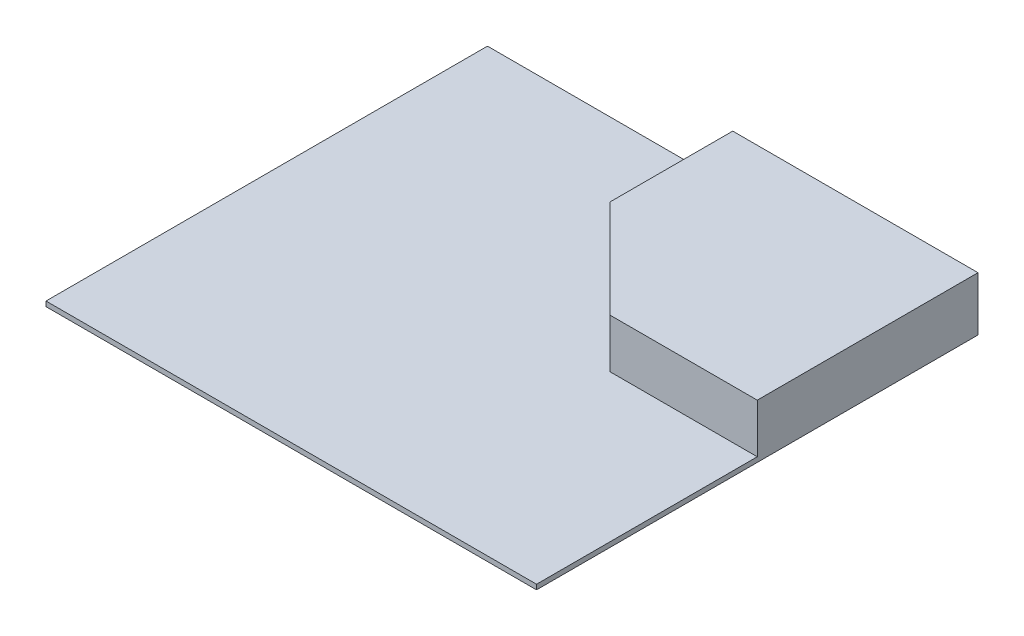
ISO-10303-21;
HEADER;
FILE_DESCRIPTION(('STEP AP214'),'2;1');
FILE_NAME('part.step','',(''),(''),'','','');
FILE_SCHEMA(('AUTOMOTIVE_DESIGN { 1 0 10303 214 1 1 1 1 }'));
ENDSEC;
DATA;
#1=APPLICATION_CONTEXT('core data for automotive mechanical design processes');
#2=APPLICATION_PROTOCOL_DEFINITION('international standard','automotive_design',2000,#1);
#3=PRODUCT_CONTEXT('',#1,'mechanical');
#4=PRODUCT('Part','Part','',(#3));
#5=PRODUCT_RELATED_PRODUCT_CATEGORY('part','',(#4));
#6=PRODUCT_DEFINITION_FORMATION('','',#4);
#7=PRODUCT_DEFINITION_CONTEXT('part definition',#1,'design');
#8=PRODUCT_DEFINITION('design','',#6,#7);
#9=PRODUCT_DEFINITION_SHAPE('','',#8);
#10=(LENGTH_UNIT() NAMED_UNIT(*) SI_UNIT(.MILLI.,.METRE.));
#11=(NAMED_UNIT(*) PLANE_ANGLE_UNIT() SI_UNIT($,.RADIAN.));
#12=(NAMED_UNIT(*) SI_UNIT($,.STERADIAN.) SOLID_ANGLE_UNIT());
#13=UNCERTAINTY_MEASURE_WITH_UNIT(LENGTH_MEASURE(1.E-05),#10,'distance_accuracy_value','');
#14=(GEOMETRIC_REPRESENTATION_CONTEXT(3) GLOBAL_UNCERTAINTY_ASSIGNED_CONTEXT((#13)) GLOBAL_UNIT_ASSIGNED_CONTEXT((#10,
#11,#12)) REPRESENTATION_CONTEXT('',''));
#15=CARTESIAN_POINT('',(0.,0.,0.));
#16=DIRECTION('',(0.,0.,1.));
#17=DIRECTION('',(1.,0.,0.));
#18=AXIS2_PLACEMENT_3D('',#15,#16,#17);
#19=CARTESIAN_POINT('',(0.,10.,0.));
#20=DIRECTION('',(0.,-1.,0.));
#21=DIRECTION('',(0.,0.,-1.));
#22=AXIS2_PLACEMENT_3D('',#19,#20,#21);
#23=PLANE('',#22);
#24=DIRECTION('',(1.,0.,0.));
#25=VECTOR('',#24,1.);
#26=CARTESIAN_POINT('',(200.,10.,0.));
#27=LINE('',#26,#25);
#28=CARTESIAN_POINT('',(200.,10.,0.));
#29=VERTEX_POINT('',#28);
#30=CARTESIAN_POINT('',(500.,10.,0.));
#31=VERTEX_POINT('',#30);
#32=EDGE_CURVE('E49',#29,#31,#27,.T.);
#33=ORIENTED_EDGE('',*,*,#32,.F.);
#34=DIRECTION('',(0.707106781186547,0.,0.707106781186548));
#35=VECTOR('',#34,1.);
#36=CARTESIAN_POINT('',(0.,10.,-200.));
#37=LINE('',#36,#35);
#38=CARTESIAN_POINT('',(0.,10.,-200.));
#39=VERTEX_POINT('',#38);
#40=EDGE_CURVE('E160',#39,#29,#37,.T.);
#41=ORIENTED_EDGE('',*,*,#40,.F.);
#42=DIRECTION('',(0.,0.,1.));
#43=VECTOR('',#42,1.);
#44=CARTESIAN_POINT('',(0.,10.,-450.));
#45=LINE('',#44,#43);
#46=CARTESIAN_POINT('',(0.,10.,-450.));
#47=VERTEX_POINT('',#46);
#48=EDGE_CURVE('E159',#47,#39,#45,.T.);
#49=ORIENTED_EDGE('',*,*,#48,.F.);
#50=DIRECTION('',(1.,0.,0.));
#51=VECTOR('',#50,1.);
#52=CARTESIAN_POINT('',(-500.,10.,-450.));
#53=LINE('',#52,#51);
#54=CARTESIAN_POINT('',(-500.,10.,-450.));
#55=VERTEX_POINT('',#54);
#56=EDGE_CURVE('E119',#55,#47,#53,.T.);
#57=ORIENTED_EDGE('',*,*,#56,.F.);
#58=DIRECTION('',(0.,0.,1.));
#59=VECTOR('',#58,1.);
#60=CARTESIAN_POINT('',(-500.,10.,-450.));
#61=LINE('',#60,#59);
#62=CARTESIAN_POINT('',(-500.,10.,450.));
#63=VERTEX_POINT('',#62);
#64=EDGE_CURVE('E134',#55,#63,#61,.T.);
#65=ORIENTED_EDGE('',*,*,#64,.T.);
#66=DIRECTION('',(1.,0.,0.));
#67=VECTOR('',#66,1.);
#68=CARTESIAN_POINT('',(-500.,10.,450.));
#69=LINE('',#68,#67);
#70=CARTESIAN_POINT('',(500.,10.,450.));
#71=VERTEX_POINT('',#70);
#72=EDGE_CURVE('E132',#63,#71,#69,.T.);
#73=ORIENTED_EDGE('',*,*,#72,.T.);
#74=DIRECTION('',(0.,0.,1.));
#75=VECTOR('',#74,1.);
#76=CARTESIAN_POINT('',(500.,10.,-450.));
#77=LINE('',#76,#75);
#78=EDGE_CURVE('E54',#31,#71,#77,.T.);
#79=ORIENTED_EDGE('',*,*,#78,.F.);
#80=EDGE_LOOP('',(#33,#41,#49,#57,#65,#73,#79));
#81=FACE_BOUND('',#80,.T.);
#82=ADVANCED_FACE('F32',(#81),#23,.F.);
#83=CARTESIAN_POINT('',(-500.,10.,-450.));
#84=DIRECTION('',(0.,0.,-1.));
#85=DIRECTION('',(-1.,0.,0.));
#86=AXIS2_PLACEMENT_3D('',#83,#84,#85);
#87=PLANE('',#86);
#88=DIRECTION('',(1.,0.,0.));
#89=VECTOR('',#88,1.);
#90=CARTESIAN_POINT('',(-500.,0.,-450.));
#91=LINE('',#90,#89);
#92=CARTESIAN_POINT('',(-500.,0.,-450.));
#93=VERTEX_POINT('',#92);
#94=CARTESIAN_POINT('',(500.,0.,-450.));
#95=VERTEX_POINT('',#94);
#96=EDGE_CURVE('E120',#93,#95,#91,.T.);
#97=ORIENTED_EDGE('',*,*,#96,.F.);
#98=DIRECTION('',(0.,-1.,0.));
#99=VECTOR('',#98,1.);
#100=CARTESIAN_POINT('',(-500.,10.,-450.));
#101=LINE('',#100,#99);
#102=EDGE_CURVE('E11',#55,#93,#101,.T.);
#103=ORIENTED_EDGE('',*,*,#102,.F.);
#104=ORIENTED_EDGE('',*,*,#56,.T.);
#105=DIRECTION('',(0.,-1.,0.));
#106=VECTOR('',#105,1.);
#107=CARTESIAN_POINT('',(0.,110.,-450.));
#108=LINE('',#107,#106);
#109=CARTESIAN_POINT('',(0.,110.,-450.));
#110=VERTEX_POINT('',#109);
#111=EDGE_CURVE('E101',#110,#47,#108,.T.);
#112=ORIENTED_EDGE('',*,*,#111,.F.);
#113=DIRECTION('',(-1.,0.,0.));
#114=VECTOR('',#113,1.);
#115=CARTESIAN_POINT('',(500.,110.,-450.));
#116=LINE('',#115,#114);
#117=CARTESIAN_POINT('',(500.,110.,-450.));
#118=VERTEX_POINT('',#117);
#119=EDGE_CURVE('E107',#118,#110,#116,.T.);
#120=ORIENTED_EDGE('',*,*,#119,.F.);
#121=DIRECTION('',(0.,-1.,0.));
#122=VECTOR('',#121,1.);
#123=CARTESIAN_POINT('',(500.,10.,-450.));
#124=LINE('',#123,#122);
#125=EDGE_CURVE('E36',#118,#95,#124,.T.);
#126=ORIENTED_EDGE('',*,*,#125,.T.);
#127=EDGE_LOOP('',(#97,#103,#104,#112,#120,#126));
#128=FACE_BOUND('',#127,.T.);
#129=ADVANCED_FACE('F34',(#128),#87,.T.);
#130=CARTESIAN_POINT('',(-500.,10.,-450.));
#131=DIRECTION('',(1.,0.,0.));
#132=DIRECTION('',(0.,0.,-1.));
#133=AXIS2_PLACEMENT_3D('',#130,#131,#132);
#134=PLANE('',#133);
#135=DIRECTION('',(0.,0.,1.));
#136=VECTOR('',#135,1.);
#137=CARTESIAN_POINT('',(-500.,0.,-450.));
#138=LINE('',#137,#136);
#139=CARTESIAN_POINT('',(-500.,0.,450.));
#140=VERTEX_POINT('',#139);
#141=EDGE_CURVE('E130',#93,#140,#138,.T.);
#142=ORIENTED_EDGE('',*,*,#141,.T.);
#143=DIRECTION('',(0.,-1.,0.));
#144=VECTOR('',#143,1.);
#145=CARTESIAN_POINT('',(-500.,10.,450.));
#146=LINE('',#145,#144);
#147=EDGE_CURVE('E41',#63,#140,#146,.T.);
#148=ORIENTED_EDGE('',*,*,#147,.F.);
#149=ORIENTED_EDGE('',*,*,#64,.F.);
#150=ORIENTED_EDGE('',*,*,#102,.T.);
#151=EDGE_LOOP('',(#142,#148,#149,#150));
#152=FACE_BOUND('',#151,.T.);
#153=ADVANCED_FACE('F154',(#152),#134,.F.);
#154=CARTESIAN_POINT('',(-500.,10.,450.));
#155=DIRECTION('',(0.,0.,-1.));
#156=DIRECTION('',(-1.,0.,0.));
#157=AXIS2_PLACEMENT_3D('',#154,#155,#156);
#158=PLANE('',#157);
#159=DIRECTION('',(1.,0.,0.));
#160=VECTOR('',#159,1.);
#161=CARTESIAN_POINT('',(-500.,0.,450.));
#162=LINE('',#161,#160);
#163=CARTESIAN_POINT('',(500.,0.,450.));
#164=VERTEX_POINT('',#163);
#165=EDGE_CURVE('E138',#140,#164,#162,.T.);
#166=ORIENTED_EDGE('',*,*,#165,.T.);
#167=DIRECTION('',(0.,-1.,0.));
#168=VECTOR('',#167,1.);
#169=CARTESIAN_POINT('',(500.,10.,450.));
#170=LINE('',#169,#168);
#171=EDGE_CURVE('E143',#71,#164,#170,.T.);
#172=ORIENTED_EDGE('',*,*,#171,.F.);
#173=ORIENTED_EDGE('',*,*,#72,.F.);
#174=ORIENTED_EDGE('',*,*,#147,.T.);
#175=EDGE_LOOP('',(#166,#172,#173,#174));
#176=FACE_BOUND('',#175,.T.);
#177=ADVANCED_FACE('F158',(#176),#158,.F.);
#178=CARTESIAN_POINT('',(500.,10.,-450.));
#179=DIRECTION('',(1.,0.,0.));
#180=DIRECTION('',(0.,0.,-1.));
#181=AXIS2_PLACEMENT_3D('',#178,#179,#180);
#182=PLANE('',#181);
#183=DIRECTION('',(0.,0.,1.));
#184=VECTOR('',#183,1.);
#185=CARTESIAN_POINT('',(500.,0.,-450.));
#186=LINE('',#185,#184);
#187=EDGE_CURVE('E123',#95,#164,#186,.T.);
#188=ORIENTED_EDGE('',*,*,#187,.F.);
#189=ORIENTED_EDGE('',*,*,#125,.F.);
#190=DIRECTION('',(0.,0.,-1.));
#191=VECTOR('',#190,1.);
#192=CARTESIAN_POINT('',(500.,110.,0.));
#193=LINE('',#192,#191);
#194=CARTESIAN_POINT('',(500.,110.,0.));
#195=VERTEX_POINT('',#194);
#196=EDGE_CURVE('E113',#195,#118,#193,.T.);
#197=ORIENTED_EDGE('',*,*,#196,.F.);
#198=DIRECTION('',(0.,-1.,0.));
#199=VECTOR('',#198,1.);
#200=CARTESIAN_POINT('',(500.,110.,0.));
#201=LINE('',#200,#199);
#202=EDGE_CURVE('E167',#195,#31,#201,.T.);
#203=ORIENTED_EDGE('',*,*,#202,.T.);
#204=ORIENTED_EDGE('',*,*,#78,.T.);
#205=ORIENTED_EDGE('',*,*,#171,.T.);
#206=EDGE_LOOP('',(#188,#189,#197,#203,#204,#205));
#207=FACE_BOUND('',#206,.T.);
#208=ADVANCED_FACE('F147',(#207),#182,.T.);
#209=CARTESIAN_POINT('',(0.,0.,0.));
#210=DIRECTION('',(0.,-1.,0.));
#211=DIRECTION('',(0.,0.,-1.));
#212=AXIS2_PLACEMENT_3D('',#209,#210,#211);
#213=PLANE('',#212);
#214=ORIENTED_EDGE('',*,*,#96,.T.);
#215=ORIENTED_EDGE('',*,*,#187,.T.);
#216=ORIENTED_EDGE('',*,*,#165,.F.);
#217=ORIENTED_EDGE('',*,*,#141,.F.);
#218=EDGE_LOOP('',(#214,#215,#216,#217));
#219=FACE_BOUND('',#218,.T.);
#220=ADVANCED_FACE('F151',(#219),#213,.T.);
#221=CARTESIAN_POINT('',(0.,110.,-450.));
#222=DIRECTION('',(1.,0.,0.));
#223=DIRECTION('',(0.,0.,-1.));
#224=AXIS2_PLACEMENT_3D('',#221,#222,#223);
#225=PLANE('',#224);
#226=ORIENTED_EDGE('',*,*,#48,.T.);
#227=DIRECTION('',(0.,-1.,0.));
#228=VECTOR('',#227,1.);
#229=CARTESIAN_POINT('',(0.,110.,-200.));
#230=LINE('',#229,#228);
#231=CARTESIAN_POINT('',(0.,110.,-200.));
#232=VERTEX_POINT('',#231);
#233=EDGE_CURVE('E103',#232,#39,#230,.T.);
#234=ORIENTED_EDGE('',*,*,#233,.F.);
#235=DIRECTION('',(0.,0.,1.));
#236=VECTOR('',#235,1.);
#237=CARTESIAN_POINT('',(0.,110.,-450.));
#238=LINE('',#237,#236);
#239=EDGE_CURVE('E96',#110,#232,#238,.T.);
#240=ORIENTED_EDGE('',*,*,#239,.F.);
#241=ORIENTED_EDGE('',*,*,#111,.T.);
#242=EDGE_LOOP('',(#226,#234,#240,#241));
#243=FACE_BOUND('',#242,.T.);
#244=ADVANCED_FACE('F99',(#243),#225,.F.);
#245=CARTESIAN_POINT('',(0.,110.,-200.));
#246=DIRECTION('',(0.707106781186548,0.,-0.707106781186547));
#247=DIRECTION('',(-0.707106781186547,0.,-0.707106781186548));
#248=AXIS2_PLACEMENT_3D('',#245,#246,#247);
#249=PLANE('',#248);
#250=ORIENTED_EDGE('',*,*,#40,.T.);
#251=DIRECTION('',(0.,-1.,0.));
#252=VECTOR('',#251,1.);
#253=CARTESIAN_POINT('',(200.,110.,0.));
#254=LINE('',#253,#252);
#255=CARTESIAN_POINT('',(200.,110.,0.));
#256=VERTEX_POINT('',#255);
#257=EDGE_CURVE('E125',#256,#29,#254,.T.);
#258=ORIENTED_EDGE('',*,*,#257,.F.);
#259=DIRECTION('',(0.707106781186547,0.,0.707106781186548));
#260=VECTOR('',#259,1.);
#261=CARTESIAN_POINT('',(0.,110.,-200.));
#262=LINE('',#261,#260);
#263=EDGE_CURVE('E106',#232,#256,#262,.T.);
#264=ORIENTED_EDGE('',*,*,#263,.F.);
#265=ORIENTED_EDGE('',*,*,#233,.T.);
#266=EDGE_LOOP('',(#250,#258,#264,#265));
#267=FACE_BOUND('',#266,.T.);
#268=ADVANCED_FACE('F177',(#267),#249,.F.);
#269=CARTESIAN_POINT('',(200.,110.,0.));
#270=DIRECTION('',(0.,0.,-1.));
#271=DIRECTION('',(-1.,0.,0.));
#272=AXIS2_PLACEMENT_3D('',#269,#270,#271);
#273=PLANE('',#272);
#274=ORIENTED_EDGE('',*,*,#32,.T.);
#275=ORIENTED_EDGE('',*,*,#202,.F.);
#276=DIRECTION('',(1.,0.,0.));
#277=VECTOR('',#276,1.);
#278=CARTESIAN_POINT('',(200.,110.,0.));
#279=LINE('',#278,#277);
#280=EDGE_CURVE('E175',#256,#195,#279,.T.);
#281=ORIENTED_EDGE('',*,*,#280,.F.);
#282=ORIENTED_EDGE('',*,*,#257,.T.);
#283=EDGE_LOOP('',(#274,#275,#281,#282));
#284=FACE_BOUND('',#283,.T.);
#285=ADVANCED_FACE('F173',(#284),#273,.F.);
#286=CARTESIAN_POINT('',(0.,110.,0.));
#287=DIRECTION('',(0.,1.,0.));
#288=DIRECTION('',(0.,0.,1.));
#289=AXIS2_PLACEMENT_3D('',#286,#287,#288);
#290=PLANE('',#289);
#291=ORIENTED_EDGE('',*,*,#119,.T.);
#292=ORIENTED_EDGE('',*,*,#239,.T.);
#293=ORIENTED_EDGE('',*,*,#263,.T.);
#294=ORIENTED_EDGE('',*,*,#280,.T.);
#295=ORIENTED_EDGE('',*,*,#196,.T.);
#296=EDGE_LOOP('',(#291,#292,#293,#294,#295));
#297=FACE_BOUND('',#296,.T.);
#298=ADVANCED_FACE('F111',(#297),#290,.T.);
#299=CLOSED_SHELL('',(#82,#129,#153,#177,#208,#220,#244,#268,#285,#298));
#300=MANIFOLD_SOLID_BREP('B2',#299);
#301=ADVANCED_BREP_SHAPE_REPRESENTATION('',(#18,#300),#14);
#302=SHAPE_DEFINITION_REPRESENTATION(#9,#301);
ENDSEC;
END-ISO-10303-21;
